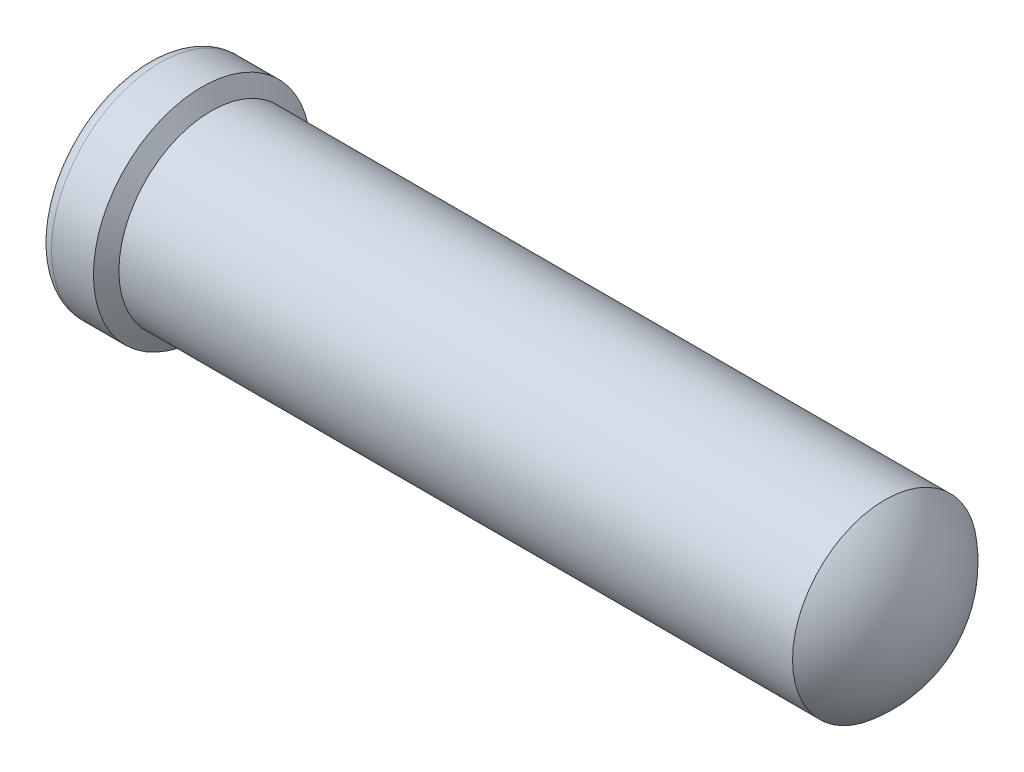
ISO-10303-21;
HEADER;
FILE_DESCRIPTION(('STEP AP214'),'2;1');
FILE_NAME('part.step','',(''),(''),'','','');
FILE_SCHEMA(('AUTOMOTIVE_DESIGN { 1 0 10303 214 1 1 1 1 }'));
ENDSEC;
DATA;
#1=APPLICATION_CONTEXT('core data for automotive mechanical design processes');
#2=APPLICATION_PROTOCOL_DEFINITION('international standard','automotive_design',2000,#1);
#3=PRODUCT_CONTEXT('',#1,'mechanical');
#4=PRODUCT('Part','Part','',(#3));
#5=PRODUCT_RELATED_PRODUCT_CATEGORY('part','',(#4));
#6=PRODUCT_DEFINITION_FORMATION('','',#4);
#7=PRODUCT_DEFINITION_CONTEXT('part definition',#1,'design');
#8=PRODUCT_DEFINITION('design','',#6,#7);
#9=PRODUCT_DEFINITION_SHAPE('','',#8);
#10=(LENGTH_UNIT() NAMED_UNIT(*) SI_UNIT(.MILLI.,.METRE.));
#11=(NAMED_UNIT(*) PLANE_ANGLE_UNIT() SI_UNIT($,.RADIAN.));
#12=(NAMED_UNIT(*) SI_UNIT($,.STERADIAN.) SOLID_ANGLE_UNIT());
#13=UNCERTAINTY_MEASURE_WITH_UNIT(LENGTH_MEASURE(1.E-05),#10,'distance_accuracy_value','');
#14=(GEOMETRIC_REPRESENTATION_CONTEXT(3) GLOBAL_UNCERTAINTY_ASSIGNED_CONTEXT((#13)) GLOBAL_UNIT_ASSIGNED_CONTEXT((#10,
#11,#12)) REPRESENTATION_CONTEXT('',''));
#15=CARTESIAN_POINT('',(0.,0.,0.));
#16=DIRECTION('',(0.,0.,1.));
#17=DIRECTION('',(1.,0.,0.));
#18=AXIS2_PLACEMENT_3D('',#15,#16,#17);
#19=CARTESIAN_POINT('',(3.78473830828801,0.0140253548861271,0.));
#20=DIRECTION('',(0.,0.,-1.));
#21=DIRECTION('',(0.,-1.,0.));
#22=AXIS2_PLACEMENT_3D('',#19,#20,#21);
#23=CIRCLE('',#22,0.7112);
#24=TRIMMED_CURVE('',#23,(PARAMETER_VALUE(-1.55107435810092)),
(PARAMETER_VALUE(1.55107435810092)),.T.,.PARAMETER.);
#25=CARTESIAN_POINT('',(3.78473830828801,0.,0.));
#26=DIRECTION('',(-1.,0.,0.));
#27=AXIS1_PLACEMENT('',#25,#26);
#28=SURFACE_OF_REVOLUTION('',#24,#27);
#29=CARTESIAN_POINT('',(4.2418,0.,0.));
#30=DIRECTION('',(-1.,0.,0.));
#31=DIRECTION('',(0.,-1.,0.));
#32=AXIS2_PLACEMENT_3D('',#29,#30,#31);
#33=CIRCLE('',#32,0.530859999999994);
#34=CARTESIAN_POINT('',(4.2418,-0.530859999999994,0.));
#35=VERTEX_POINT('',#34);
#36=EDGE_CURVE('E11',#35,#35,#33,.T.);
#37=ORIENTED_EDGE('',*,*,#36,.F.);
#38=EDGE_LOOP('',(#37));
#39=FACE_BOUND('',#38,.T.);
#40=CARTESIAN_POINT('',(4.4958,0.,0.));
#41=VERTEX_POINT('',#40);
#42=VERTEX_LOOP('',#41);
#43=FACE_BOUND('',#42,.T.);
#44=ADVANCED_FACE('F34',(#39,#43),#28,.T.);
#45=CARTESIAN_POINT('',(0.,0.,0.));
#46=DIRECTION('',(-1.,0.,0.));
#47=DIRECTION('',(0.,-1.,0.));
#48=AXIS2_PLACEMENT_3D('',#45,#46,#47);
#49=CYLINDRICAL_SURFACE('',#48,0.530859999999994);
#50=CARTESIAN_POINT('',(0.371026143456576,0.,0.));
#51=DIRECTION('',(-1.,0.,0.));
#52=DIRECTION('',(0.,-1.,0.));
#53=AXIS2_PLACEMENT_3D('',#50,#51,#52);
#54=CIRCLE('',#53,0.530859999999994);
#55=CARTESIAN_POINT('',(0.371026143456577,-0.530859999999996,0.));
#56=VERTEX_POINT('',#55);
#57=EDGE_CURVE('E41',#56,#56,#54,.T.);
#58=ORIENTED_EDGE('',*,*,#57,.F.);
#59=EDGE_LOOP('',(#58));
#60=FACE_BOUND('',#59,.T.);
#61=ORIENTED_EDGE('',*,*,#36,.T.);
#62=EDGE_LOOP('',(#61));
#63=FACE_BOUND('',#62,.T.);
#64=ADVANCED_FACE('F77',(#60,#63),#49,.T.);
#65=CARTESIAN_POINT('',(0.371026143456576,0.,0.));
#66=DIRECTION('',(-1.,0.,0.));
#67=DIRECTION('',(0.,-1.,0.));
#68=AXIS2_PLACEMENT_3D('',#65,#66,#67);
#69=CONICAL_SURFACE('',#68,0.530859999999994,1.04719755119674);
#70=CARTESIAN_POINT('',(0.317500000000026,0.,0.));
#71=DIRECTION('',(-1.,0.,0.));
#72=DIRECTION('',(0.,-1.,0.));
#73=AXIS2_PLACEMENT_3D('',#70,#71,#72);
#74=CIRCLE('',#73,0.62356999999999);
#75=CARTESIAN_POINT('',(0.317500000000026,-0.623569999999991,0.));
#76=VERTEX_POINT('',#75);
#77=EDGE_CURVE('E70',#76,#76,#74,.T.);
#78=ORIENTED_EDGE('',*,*,#77,.F.);
#79=EDGE_LOOP('',(#78));
#80=FACE_BOUND('',#79,.T.);
#81=ORIENTED_EDGE('',*,*,#57,.T.);
#82=EDGE_LOOP('',(#81));
#83=FACE_BOUND('',#82,.T.);
#84=ADVANCED_FACE('F75',(#80,#83),#69,.T.);
#85=CARTESIAN_POINT('',(0.,0.,0.));
#86=DIRECTION('',(-1.,0.,0.));
#87=DIRECTION('',(0.,-1.,0.));
#88=AXIS2_PLACEMENT_3D('',#85,#86,#87);
#89=CYLINDRICAL_SURFACE('',#88,0.62356999999999);
#90=CARTESIAN_POINT('',(0.0762000000000011,0.,0.));
#91=DIRECTION('',(-1.,0.,0.));
#92=DIRECTION('',(0.,-1.,0.));
#93=AXIS2_PLACEMENT_3D('',#90,#91,#92);
#94=CIRCLE('',#93,0.62356999999999);
#95=CARTESIAN_POINT('',(0.0762000000000012,-0.623569999999992,0.));
#96=VERTEX_POINT('',#95);
#97=EDGE_CURVE('E61',#96,#96,#94,.T.);
#98=ORIENTED_EDGE('',*,*,#97,.F.);
#99=EDGE_LOOP('',(#98));
#100=FACE_BOUND('',#99,.T.);
#101=ORIENTED_EDGE('',*,*,#77,.T.);
#102=EDGE_LOOP('',(#101));
#103=FACE_BOUND('',#102,.T.);
#104=ADVANCED_FACE('F95',(#100,#103),#89,.T.);
#105=CARTESIAN_POINT('',(0.0762000000000002,0.,0.));
#106=DIRECTION('',(-1.,0.,0.));
#107=DIRECTION('',(0.,-1.,0.));
#108=AXIS2_PLACEMENT_3D('',#105,#106,#107);
#109=TOROIDAL_SURFACE('',#108,0.54736999999999,0.0762);
#110=CARTESIAN_POINT('',(0.,0.,0.));
#111=DIRECTION('',(-1.,0.,0.));
#112=DIRECTION('',(0.,-1.,0.));
#113=AXIS2_PLACEMENT_3D('',#110,#111,#112);
#114=CIRCLE('',#113,0.547369999999989);
#115=CARTESIAN_POINT('',(0.,-0.547369999999991,0.));
#116=VERTEX_POINT('',#115);
#117=EDGE_CURVE('E57',#116,#116,#114,.T.);
#118=ORIENTED_EDGE('',*,*,#117,.F.);
#119=EDGE_LOOP('',(#118));
#120=FACE_BOUND('',#119,.T.);
#121=ORIENTED_EDGE('',*,*,#97,.T.);
#122=EDGE_LOOP('',(#121));
#123=FACE_BOUND('',#122,.T.);
#124=ADVANCED_FACE('F103',(#120,#123),#109,.T.);
#125=CARTESIAN_POINT('',(0.,0.,0.));
#126=DIRECTION('',(1.,0.,0.));
#127=DIRECTION('',(0.,1.,0.));
#128=AXIS2_PLACEMENT_3D('',#125,#126,#127);
#129=PLANE('',#128);
#130=CARTESIAN_POINT('',(0.,0.,0.));
#131=DIRECTION('',(-1.,0.,0.));
#132=DIRECTION('',(0.,0.,1.));
#133=AXIS2_PLACEMENT_3D('',#130,#131,#132);
#134=CIRCLE('',#133,0.546100000000001);
#135=CARTESIAN_POINT('',(0.,0.,0.546100000000002));
#136=VERTEX_POINT('',#135);
#137=EDGE_CURVE('E64',#136,#136,#134,.T.);
#138=ORIENTED_EDGE('',*,*,#137,.F.);
#139=EDGE_LOOP('',(#138));
#140=FACE_BOUND('',#139,.T.);
#141=ORIENTED_EDGE('',*,*,#117,.T.);
#142=EDGE_LOOP('',(#141));
#143=FACE_BOUND('',#142,.T.);
#144=ADVANCED_FACE('F51',(#140,#143),#129,.F.);
#145=CARTESIAN_POINT('',(1.9304,0.,0.));
#146=DIRECTION('',(-1.,0.,0.));
#147=DIRECTION('',(0.,0.,1.));
#148=AXIS2_PLACEMENT_3D('',#145,#146,#147);
#149=CONICAL_SURFACE('',#148,0.457200000000001,1.02974425867666);
#150=CARTESIAN_POINT('',(2.2051134750194,0.,0.));
#151=VERTEX_POINT('',#150);
#152=VERTEX_LOOP('',#151);
#153=FACE_BOUND('',#152,.T.);
#154=CARTESIAN_POINT('',(1.9304,0.,0.));
#155=DIRECTION('',(-1.,0.,0.));
#156=DIRECTION('',(0.,0.,1.));
#157=AXIS2_PLACEMENT_3D('',#154,#155,#156);
#158=CIRCLE('',#157,0.457200000000001);
#159=CARTESIAN_POINT('',(1.9304,0.,0.457200000000002));
#160=VERTEX_POINT('',#159);
#161=EDGE_CURVE('E55',#160,#160,#158,.T.);
#162=ORIENTED_EDGE('',*,*,#161,.T.);
#163=EDGE_LOOP('',(#162));
#164=FACE_BOUND('',#163,.T.);
#165=ADVANCED_FACE('F47',(#153,#164),#149,.F.);
#166=CARTESIAN_POINT('',(0.,0.,0.));
#167=DIRECTION('',(-1.,0.,0.));
#168=DIRECTION('',(0.,0.,1.));
#169=AXIS2_PLACEMENT_3D('',#166,#167,#168);
#170=CYLINDRICAL_SURFACE('',#169,0.457200000000001);
#171=ORIENTED_EDGE('',*,*,#161,.F.);
#172=EDGE_LOOP('',(#171));
#173=FACE_BOUND('',#172,.T.);
#174=CARTESIAN_POINT('',(0.0889000000000003,0.,0.));
#175=DIRECTION('',(-1.,0.,0.));
#176=DIRECTION('',(0.,0.,1.));
#177=AXIS2_PLACEMENT_3D('',#174,#175,#176);
#178=CIRCLE('',#177,0.4572);
#179=CARTESIAN_POINT('',(0.0889000000000003,0.,0.457200000000001));
#180=VERTEX_POINT('',#179);
#181=EDGE_CURVE('E58',#180,#180,#178,.T.);
#182=ORIENTED_EDGE('',*,*,#181,.T.);
#183=EDGE_LOOP('',(#182));
#184=FACE_BOUND('',#183,.T.);
#185=ADVANCED_FACE('F50',(#173,#184),#170,.F.);
#186=CARTESIAN_POINT('',(0.,0.,0.));
#187=DIRECTION('',(-1.,0.,0.));
#188=DIRECTION('',(0.,0.,1.));
#189=AXIS2_PLACEMENT_3D('',#186,#187,#188);
#190=CONICAL_SURFACE('',#189,0.546100000000001,0.785398163397443);
#191=ORIENTED_EDGE('',*,*,#181,.F.);
#192=EDGE_LOOP('',(#191));
#193=FACE_BOUND('',#192,.T.);
#194=ORIENTED_EDGE('',*,*,#137,.T.);
#195=EDGE_LOOP('',(#194));
#196=FACE_BOUND('',#195,.T.);
#197=ADVANCED_FACE('F129',(#193,#196),#190,.F.);
#198=CLOSED_SHELL('',(#44,#64,#84,#104,#124,#144,#165,#185,#197));
#199=MANIFOLD_SOLID_BREP('B2',#198);
#200=ADVANCED_BREP_SHAPE_REPRESENTATION('',(#18,#199),#14);
#201=SHAPE_DEFINITION_REPRESENTATION(#9,#200);
ENDSEC;
END-ISO-10303-21;
